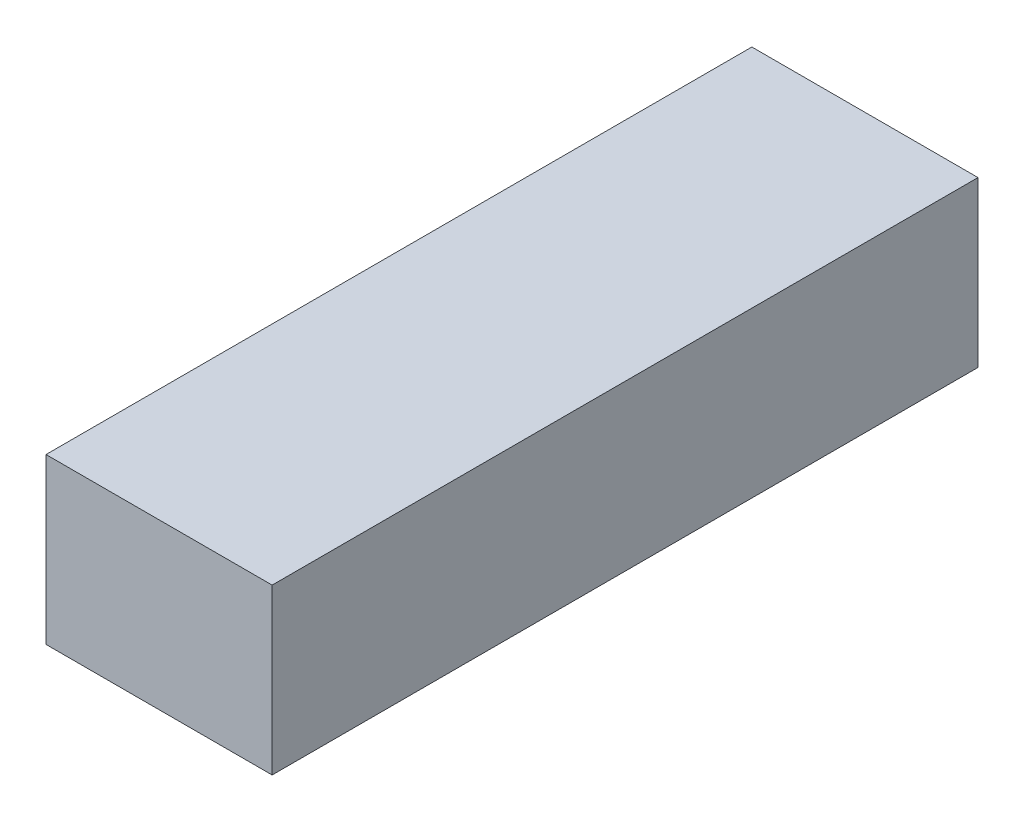
ISO-10303-21;
HEADER;
FILE_DESCRIPTION(('STEP AP214'),'2;1');
FILE_NAME('part.step','',(''),(''),'','','');
FILE_SCHEMA(('AUTOMOTIVE_DESIGN { 1 0 10303 214 1 1 1 1 }'));
ENDSEC;
DATA;
#1=APPLICATION_CONTEXT('core data for automotive mechanical design processes');
#2=APPLICATION_PROTOCOL_DEFINITION('international standard','automotive_design',2000,#1);
#3=PRODUCT_CONTEXT('',#1,'mechanical');
#4=PRODUCT('Part','Part','',(#3));
#5=PRODUCT_RELATED_PRODUCT_CATEGORY('part','',(#4));
#6=PRODUCT_DEFINITION_FORMATION('','',#4);
#7=PRODUCT_DEFINITION_CONTEXT('part definition',#1,'design');
#8=PRODUCT_DEFINITION('design','',#6,#7);
#9=PRODUCT_DEFINITION_SHAPE('','',#8);
#10=(LENGTH_UNIT() NAMED_UNIT(*) SI_UNIT(.MILLI.,.METRE.));
#11=(NAMED_UNIT(*) PLANE_ANGLE_UNIT() SI_UNIT($,.RADIAN.));
#12=(NAMED_UNIT(*) SI_UNIT($,.STERADIAN.) SOLID_ANGLE_UNIT());
#13=UNCERTAINTY_MEASURE_WITH_UNIT(LENGTH_MEASURE(1.E-05),#10,'distance_accuracy_value','');
#14=(GEOMETRIC_REPRESENTATION_CONTEXT(3) GLOBAL_UNCERTAINTY_ASSIGNED_CONTEXT((#13)) GLOBAL_UNIT_ASSIGNED_CONTEXT((#10,
#11,#12)) REPRESENTATION_CONTEXT('',''));
#15=CARTESIAN_POINT('',(0.,0.,0.));
#16=DIRECTION('',(0.,0.,1.));
#17=DIRECTION('',(1.,0.,0.));
#18=AXIS2_PLACEMENT_3D('',#15,#16,#17);
#19=CARTESIAN_POINT('',(16.5,24.,51.5));
#20=DIRECTION('',(-1.,0.,0.));
#21=DIRECTION('',(0.,0.,1.));
#22=AXIS2_PLACEMENT_3D('',#19,#20,#21);
#23=PLANE('',#22);
#24=DIRECTION('',(0.,0.,-1.));
#25=VECTOR('',#24,1.);
#26=CARTESIAN_POINT('',(16.5,0.,51.5));
#27=LINE('',#26,#25);
#28=CARTESIAN_POINT('',(16.5,0.,51.5));
#29=VERTEX_POINT('',#28);
#30=CARTESIAN_POINT('',(16.5,0.,-51.5));
#31=VERTEX_POINT('',#30);
#32=EDGE_CURVE('E95',#29,#31,#27,.T.);
#33=ORIENTED_EDGE('',*,*,#32,.T.);
#34=DIRECTION('',(0.,-1.,0.));
#35=VECTOR('',#34,1.);
#36=CARTESIAN_POINT('',(16.5,24.,-51.5));
#37=LINE('',#36,#35);
#38=CARTESIAN_POINT('',(16.5,24.,-51.5));
#39=VERTEX_POINT('',#38);
#40=EDGE_CURVE('E11',#39,#31,#37,.T.);
#41=ORIENTED_EDGE('',*,*,#40,.F.);
#42=DIRECTION('',(0.,0.,-1.));
#43=VECTOR('',#42,1.);
#44=CARTESIAN_POINT('',(16.5,24.,51.5));
#45=LINE('',#44,#43);
#46=CARTESIAN_POINT('',(16.5,24.,51.5));
#47=VERTEX_POINT('',#46);
#48=EDGE_CURVE('E83',#47,#39,#45,.T.);
#49=ORIENTED_EDGE('',*,*,#48,.F.);
#50=DIRECTION('',(0.,-1.,0.));
#51=VECTOR('',#50,1.);
#52=CARTESIAN_POINT('',(16.5,24.,51.5));
#53=LINE('',#52,#51);
#54=EDGE_CURVE('E91',#47,#29,#53,.T.);
#55=ORIENTED_EDGE('',*,*,#54,.T.);
#56=EDGE_LOOP('',(#33,#41,#49,#55));
#57=FACE_BOUND('',#56,.T.);
#58=ADVANCED_FACE('F32',(#57),#23,.F.);
#59=CARTESIAN_POINT('',(-16.5,24.,-51.5));
#60=DIRECTION('',(0.,0.,1.));
#61=DIRECTION('',(1.,0.,0.));
#62=AXIS2_PLACEMENT_3D('',#59,#60,#61);
#63=PLANE('',#62);
#64=DIRECTION('',(-1.,0.,0.));
#65=VECTOR('',#64,1.);
#66=CARTESIAN_POINT('',(-16.5,0.,-51.5));
#67=LINE('',#66,#65);
#68=CARTESIAN_POINT('',(-16.5,0.,-51.5));
#69=VERTEX_POINT('',#68);
#70=EDGE_CURVE('E87',#31,#69,#67,.T.);
#71=ORIENTED_EDGE('',*,*,#70,.T.);
#72=DIRECTION('',(0.,-1.,0.));
#73=VECTOR('',#72,1.);
#74=CARTESIAN_POINT('',(-16.5,24.,-51.5));
#75=LINE('',#74,#73);
#76=CARTESIAN_POINT('',(-16.5,24.,-51.5));
#77=VERTEX_POINT('',#76);
#78=EDGE_CURVE('E40',#77,#69,#75,.T.);
#79=ORIENTED_EDGE('',*,*,#78,.F.);
#80=DIRECTION('',(-1.,0.,0.));
#81=VECTOR('',#80,1.);
#82=CARTESIAN_POINT('',(-16.5,24.,-51.5));
#83=LINE('',#82,#81);
#84=EDGE_CURVE('E78',#39,#77,#83,.T.);
#85=ORIENTED_EDGE('',*,*,#84,.F.);
#86=ORIENTED_EDGE('',*,*,#40,.T.);
#87=EDGE_LOOP('',(#71,#79,#85,#86));
#88=FACE_BOUND('',#87,.T.);
#89=ADVANCED_FACE('F86',(#88),#63,.F.);
#90=CARTESIAN_POINT('',(-16.5,24.,51.5));
#91=DIRECTION('',(1.,0.,0.));
#92=DIRECTION('',(0.,0.,-1.));
#93=AXIS2_PLACEMENT_3D('',#90,#91,#92);
#94=PLANE('',#93);
#95=DIRECTION('',(0.,0.,1.));
#96=VECTOR('',#95,1.);
#97=CARTESIAN_POINT('',(-16.5,0.,51.5));
#98=LINE('',#97,#96);
#99=CARTESIAN_POINT('',(-16.5,0.,51.5));
#100=VERTEX_POINT('',#99);
#101=EDGE_CURVE('E65',#69,#100,#98,.T.);
#102=ORIENTED_EDGE('',*,*,#101,.T.);
#103=DIRECTION('',(0.,-1.,0.));
#104=VECTOR('',#103,1.);
#105=CARTESIAN_POINT('',(-16.5,24.,51.5));
#106=LINE('',#105,#104);
#107=CARTESIAN_POINT('',(-16.5,24.,51.5));
#108=VERTEX_POINT('',#107);
#109=EDGE_CURVE('E88',#108,#100,#106,.T.);
#110=ORIENTED_EDGE('',*,*,#109,.F.);
#111=DIRECTION('',(0.,0.,1.));
#112=VECTOR('',#111,1.);
#113=CARTESIAN_POINT('',(-16.5,24.,51.5));
#114=LINE('',#113,#112);
#115=EDGE_CURVE('E81',#77,#108,#114,.T.);
#116=ORIENTED_EDGE('',*,*,#115,.F.);
#117=ORIENTED_EDGE('',*,*,#78,.T.);
#118=EDGE_LOOP('',(#102,#110,#116,#117));
#119=FACE_BOUND('',#118,.T.);
#120=ADVANCED_FACE('F89',(#119),#94,.F.);
#121=CARTESIAN_POINT('',(-16.5,24.,51.5));
#122=DIRECTION('',(0.,0.,-1.));
#123=DIRECTION('',(-1.,0.,0.));
#124=AXIS2_PLACEMENT_3D('',#121,#122,#123);
#125=PLANE('',#124);
#126=DIRECTION('',(1.,0.,0.));
#127=VECTOR('',#126,1.);
#128=CARTESIAN_POINT('',(-16.5,0.,51.5));
#129=LINE('',#128,#127);
#130=EDGE_CURVE('E71',#100,#29,#129,.T.);
#131=ORIENTED_EDGE('',*,*,#130,.T.);
#132=ORIENTED_EDGE('',*,*,#54,.F.);
#133=DIRECTION('',(1.,0.,0.));
#134=VECTOR('',#133,1.);
#135=CARTESIAN_POINT('',(-16.5,24.,51.5));
#136=LINE('',#135,#134);
#137=EDGE_CURVE('E48',#108,#47,#136,.T.);
#138=ORIENTED_EDGE('',*,*,#137,.F.);
#139=ORIENTED_EDGE('',*,*,#109,.T.);
#140=EDGE_LOOP('',(#131,#132,#138,#139));
#141=FACE_BOUND('',#140,.T.);
#142=ADVANCED_FACE('F102',(#141),#125,.F.);
#143=CARTESIAN_POINT('',(0.,24.,0.));
#144=DIRECTION('',(0.,-1.,0.));
#145=DIRECTION('',(0.,0.,-1.));
#146=AXIS2_PLACEMENT_3D('',#143,#144,#145);
#147=PLANE('',#146);
#148=ORIENTED_EDGE('',*,*,#48,.T.);
#149=ORIENTED_EDGE('',*,*,#84,.T.);
#150=ORIENTED_EDGE('',*,*,#115,.T.);
#151=ORIENTED_EDGE('',*,*,#137,.T.);
#152=EDGE_LOOP('',(#148,#149,#150,#151));
#153=FACE_BOUND('',#152,.T.);
#154=ADVANCED_FACE('F79',(#153),#147,.F.);
#155=CARTESIAN_POINT('',(0.,0.,0.));
#156=DIRECTION('',(0.,-1.,0.));
#157=DIRECTION('',(0.,0.,-1.));
#158=AXIS2_PLACEMENT_3D('',#155,#156,#157);
#159=PLANE('',#158);
#160=ORIENTED_EDGE('',*,*,#32,.F.);
#161=ORIENTED_EDGE('',*,*,#130,.F.);
#162=ORIENTED_EDGE('',*,*,#101,.F.);
#163=ORIENTED_EDGE('',*,*,#70,.F.);
#164=EDGE_LOOP('',(#160,#161,#162,#163));
#165=FACE_BOUND('',#164,.T.);
#166=ADVANCED_FACE('F105',(#165),#159,.T.);
#167=CLOSED_SHELL('',(#58,#89,#120,#142,#154,#166));
#168=MANIFOLD_SOLID_BREP('B2',#167);
#169=ADVANCED_BREP_SHAPE_REPRESENTATION('',(#18,#168),#14);
#170=SHAPE_DEFINITION_REPRESENTATION(#9,#169);
ENDSEC;
END-ISO-10303-21;
